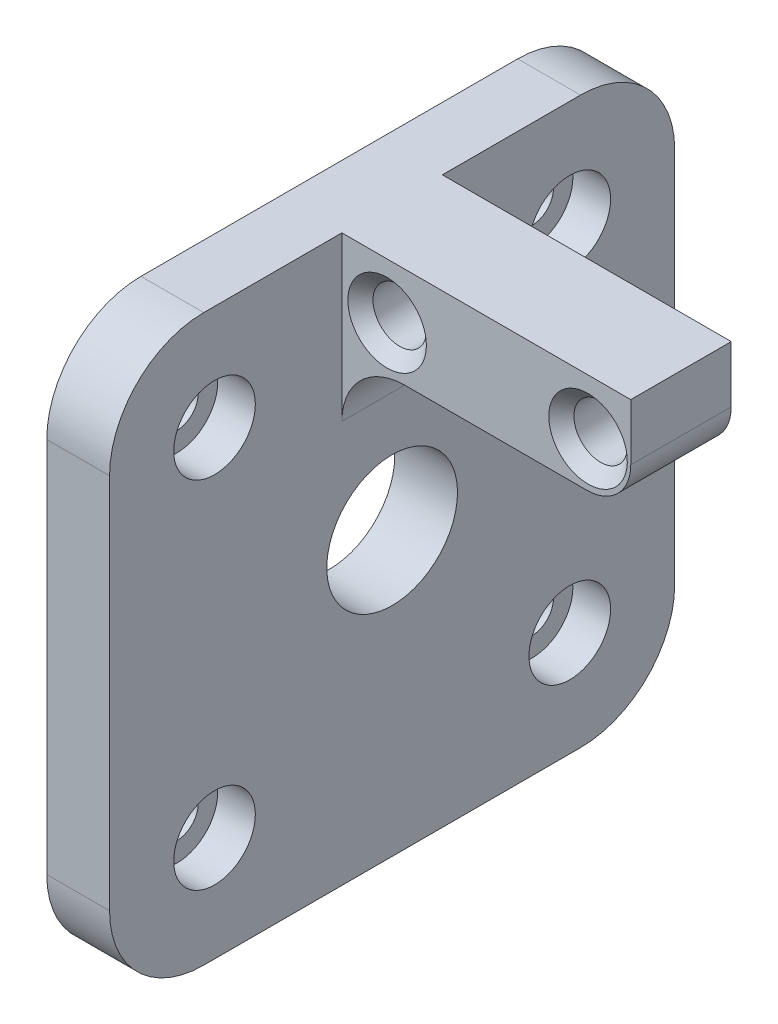
ISO-10303-21;
HEADER;
FILE_DESCRIPTION(('STEP AP214'),'2;1');
FILE_NAME('part.step','',(''),(''),'','','');
FILE_SCHEMA(('AUTOMOTIVE_DESIGN { 1 0 10303 214 1 1 1 1 }'));
ENDSEC;
DATA;
#1=APPLICATION_CONTEXT('core data for automotive mechanical design processes');
#2=APPLICATION_PROTOCOL_DEFINITION('international standard','automotive_design',2000,#1);
#3=PRODUCT_CONTEXT('',#1,'mechanical');
#4=PRODUCT('Part','Part','',(#3));
#5=PRODUCT_RELATED_PRODUCT_CATEGORY('part','',(#4));
#6=PRODUCT_DEFINITION_FORMATION('','',#4);
#7=PRODUCT_DEFINITION_CONTEXT('part definition',#1,'design');
#8=PRODUCT_DEFINITION('design','',#6,#7);
#9=PRODUCT_DEFINITION_SHAPE('','',#8);
#10=(LENGTH_UNIT() NAMED_UNIT(*) SI_UNIT(.MILLI.,.METRE.));
#11=(NAMED_UNIT(*) PLANE_ANGLE_UNIT() SI_UNIT($,.RADIAN.));
#12=(NAMED_UNIT(*) SI_UNIT($,.STERADIAN.) SOLID_ANGLE_UNIT());
#13=UNCERTAINTY_MEASURE_WITH_UNIT(LENGTH_MEASURE(1.E-05),#10,'distance_accuracy_value','');
#14=(GEOMETRIC_REPRESENTATION_CONTEXT(3) GLOBAL_UNCERTAINTY_ASSIGNED_CONTEXT((#13)) GLOBAL_UNIT_ASSIGNED_CONTEXT((#10,
#11,#12)) REPRESENTATION_CONTEXT('',''));
#15=CARTESIAN_POINT('',(0.,0.,0.));
#16=DIRECTION('',(0.,0.,1.));
#17=DIRECTION('',(1.,0.,0.));
#18=AXIS2_PLACEMENT_3D('',#15,#16,#17);
#19=CARTESIAN_POINT('',(5.,22.5,0.));
#20=DIRECTION('',(0.,1.,0.));
#21=DIRECTION('',(0.,0.,1.));
#22=AXIS2_PLACEMENT_3D('',#19,#20,#21);
#23=PLANE('',#22);
#24=DIRECTION('',(0.,0.,-1.));
#25=VECTOR('',#24,1.);
#26=CARTESIAN_POINT('',(5.,22.5,0.));
#27=LINE('',#26,#25);
#28=CARTESIAN_POINT('',(5.,22.5,-4.));
#29=VERTEX_POINT('',#28);
#30=CARTESIAN_POINT('',(5.,22.5,-15.));
#31=VERTEX_POINT('',#30);
#32=EDGE_CURVE('E215',#29,#31,#27,.T.);
#33=ORIENTED_EDGE('',*,*,#32,.T.);
#34=DIRECTION('',(-1.,0.,0.));
#35=VECTOR('',#34,1.);
#36=CARTESIAN_POINT('',(0.,22.5,-15.));
#37=LINE('',#36,#35);
#38=CARTESIAN_POINT('',(0.,22.5,-15.));
#39=VERTEX_POINT('',#38);
#40=EDGE_CURVE('E291',#31,#39,#37,.T.);
#41=ORIENTED_EDGE('',*,*,#40,.T.);
#42=DIRECTION('',(0.,0.,-1.));
#43=VECTOR('',#42,1.);
#44=CARTESIAN_POINT('',(0.,22.5,0.));
#45=LINE('',#44,#43);
#46=CARTESIAN_POINT('',(0.,22.5,15.));
#47=VERTEX_POINT('',#46);
#48=EDGE_CURVE('E210',#47,#39,#45,.T.);
#49=ORIENTED_EDGE('',*,*,#48,.F.);
#50=DIRECTION('',(-1.,0.,0.));
#51=VECTOR('',#50,1.);
#52=CARTESIAN_POINT('',(5.,22.5,15.));
#53=LINE('',#52,#51);
#54=CARTESIAN_POINT('',(5.,22.5,15.));
#55=VERTEX_POINT('',#54);
#56=EDGE_CURVE('E288',#47,#55,#53,.F.);
#57=ORIENTED_EDGE('',*,*,#56,.T.);
#58=CARTESIAN_POINT('',(5.,22.5,4.));
#59=VERTEX_POINT('',#58);
#60=EDGE_CURVE('E211',#55,#59,#27,.T.);
#61=ORIENTED_EDGE('',*,*,#60,.T.);
#62=DIRECTION('',(-1.,0.,0.));
#63=VECTOR('',#62,1.);
#64=CARTESIAN_POINT('',(28.,22.5,4.));
#65=LINE('',#64,#63);
#66=CARTESIAN_POINT('',(28.,22.5,4.));
#67=VERTEX_POINT('',#66);
#68=EDGE_CURVE('E176',#67,#59,#65,.T.);
#69=ORIENTED_EDGE('',*,*,#68,.F.);
#70=DIRECTION('',(0.,0.,-1.));
#71=VECTOR('',#70,1.);
#72=CARTESIAN_POINT('',(28.,22.5,0.));
#73=LINE('',#72,#71);
#74=CARTESIAN_POINT('',(28.,22.5,-4.));
#75=VERTEX_POINT('',#74);
#76=EDGE_CURVE('E183',#67,#75,#73,.T.);
#77=ORIENTED_EDGE('',*,*,#76,.T.);
#78=DIRECTION('',(-1.,0.,0.));
#79=VECTOR('',#78,1.);
#80=CARTESIAN_POINT('',(28.,22.5,-4.));
#81=LINE('',#80,#79);
#82=EDGE_CURVE('E164',#75,#29,#81,.T.);
#83=ORIENTED_EDGE('',*,*,#82,.T.);
#84=EDGE_LOOP('',(#33,#41,#49,#57,#61,#69,#77,#83));
#85=FACE_BOUND('',#84,.T.);
#86=ADVANCED_FACE('F51',(#85),#23,.T.);
#87=CARTESIAN_POINT('',(5.,0.,22.5));
#88=DIRECTION('',(0.,0.,1.));
#89=DIRECTION('',(1.,0.,0.));
#90=AXIS2_PLACEMENT_3D('',#87,#88,#89);
#91=PLANE('',#90);
#92=DIRECTION('',(0.,1.,0.));
#93=VECTOR('',#92,1.);
#94=CARTESIAN_POINT('',(0.,0.,22.5));
#95=LINE('',#94,#93);
#96=CARTESIAN_POINT('',(0.,-15.,22.5));
#97=VERTEX_POINT('',#96);
#98=CARTESIAN_POINT('',(0.,15.,22.5));
#99=VERTEX_POINT('',#98);
#100=EDGE_CURVE('E235',#97,#99,#95,.T.);
#101=ORIENTED_EDGE('',*,*,#100,.F.);
#102=DIRECTION('',(-1.,0.,0.));
#103=VECTOR('',#102,1.);
#104=CARTESIAN_POINT('',(5.,-15.,22.5));
#105=LINE('',#104,#103);
#106=CARTESIAN_POINT('',(5.,-15.,22.5));
#107=VERTEX_POINT('',#106);
#108=EDGE_CURVE('E269',#97,#107,#105,.F.);
#109=ORIENTED_EDGE('',*,*,#108,.T.);
#110=DIRECTION('',(0.,1.,0.));
#111=VECTOR('',#110,1.);
#112=CARTESIAN_POINT('',(5.,0.,22.5));
#113=LINE('',#112,#111);
#114=CARTESIAN_POINT('',(5.,15.,22.5));
#115=VERTEX_POINT('',#114);
#116=EDGE_CURVE('E214',#107,#115,#113,.T.);
#117=ORIENTED_EDGE('',*,*,#116,.T.);
#118=DIRECTION('',(-1.,0.,0.));
#119=VECTOR('',#118,1.);
#120=CARTESIAN_POINT('',(5.,15.,22.5));
#121=LINE('',#120,#119);
#122=EDGE_CURVE('E266',#115,#99,#121,.T.);
#123=ORIENTED_EDGE('',*,*,#122,.T.);
#124=EDGE_LOOP('',(#101,#109,#117,#123));
#125=FACE_BOUND('',#124,.T.);
#126=ADVANCED_FACE('F361',(#125),#91,.T.);
#127=CARTESIAN_POINT('',(5.,-22.5,0.));
#128=DIRECTION('',(0.,1.,0.));
#129=DIRECTION('',(0.,0.,1.));
#130=AXIS2_PLACEMENT_3D('',#127,#128,#129);
#131=PLANE('',#130);
#132=DIRECTION('',(0.,0.,-1.));
#133=VECTOR('',#132,1.);
#134=CARTESIAN_POINT('',(5.,-22.5,0.));
#135=LINE('',#134,#133);
#136=CARTESIAN_POINT('',(5.,-22.5,15.));
#137=VERTEX_POINT('',#136);
#138=CARTESIAN_POINT('',(5.,-22.5,-15.));
#139=VERTEX_POINT('',#138);
#140=EDGE_CURVE('E219',#137,#139,#135,.T.);
#141=ORIENTED_EDGE('',*,*,#140,.F.);
#142=DIRECTION('',(-1.,0.,0.));
#143=VECTOR('',#142,1.);
#144=CARTESIAN_POINT('',(0.,-22.5,15.));
#145=LINE('',#144,#143);
#146=CARTESIAN_POINT('',(0.,-22.5,15.));
#147=VERTEX_POINT('',#146);
#148=EDGE_CURVE('E251',#137,#147,#145,.T.);
#149=ORIENTED_EDGE('',*,*,#148,.T.);
#150=DIRECTION('',(0.,0.,-1.));
#151=VECTOR('',#150,1.);
#152=CARTESIAN_POINT('',(0.,-22.5,0.));
#153=LINE('',#152,#151);
#154=CARTESIAN_POINT('',(0.,-22.5,-15.));
#155=VERTEX_POINT('',#154);
#156=EDGE_CURVE('E238',#147,#155,#153,.T.);
#157=ORIENTED_EDGE('',*,*,#156,.T.);
#158=DIRECTION('',(-1.,0.,0.));
#159=VECTOR('',#158,1.);
#160=CARTESIAN_POINT('',(5.,-22.5,-15.));
#161=LINE('',#160,#159);
#162=EDGE_CURVE('E231',#155,#139,#161,.F.);
#163=ORIENTED_EDGE('',*,*,#162,.T.);
#164=EDGE_LOOP('',(#141,#149,#157,#163));
#165=FACE_BOUND('',#164,.T.);
#166=ADVANCED_FACE('F366',(#165),#131,.F.);
#167=CARTESIAN_POINT('',(5.,0.,-22.5));
#168=DIRECTION('',(0.,0.,1.));
#169=DIRECTION('',(1.,0.,0.));
#170=AXIS2_PLACEMENT_3D('',#167,#168,#169);
#171=PLANE('',#170);
#172=DIRECTION('',(0.,1.,0.));
#173=VECTOR('',#172,1.);
#174=CARTESIAN_POINT('',(5.,0.,-22.5));
#175=LINE('',#174,#173);
#176=CARTESIAN_POINT('',(5.,-15.,-22.5));
#177=VERTEX_POINT('',#176);
#178=CARTESIAN_POINT('',(5.,15.,-22.5));
#179=VERTEX_POINT('',#178);
#180=EDGE_CURVE('E223',#177,#179,#175,.T.);
#181=ORIENTED_EDGE('',*,*,#180,.F.);
#182=DIRECTION('',(-1.,0.,0.));
#183=VECTOR('',#182,1.);
#184=CARTESIAN_POINT('',(5.,-15.,-22.5));
#185=LINE('',#184,#183);
#186=CARTESIAN_POINT('',(0.,-15.,-22.5));
#187=VERTEX_POINT('',#186);
#188=EDGE_CURVE('E285',#177,#187,#185,.T.);
#189=ORIENTED_EDGE('',*,*,#188,.T.);
#190=DIRECTION('',(0.,1.,0.));
#191=VECTOR('',#190,1.);
#192=CARTESIAN_POINT('',(0.,0.,-22.5));
#193=LINE('',#192,#191);
#194=CARTESIAN_POINT('',(0.,15.,-22.5));
#195=VERTEX_POINT('',#194);
#196=EDGE_CURVE('E242',#187,#195,#193,.T.);
#197=ORIENTED_EDGE('',*,*,#196,.T.);
#198=DIRECTION('',(-1.,0.,0.));
#199=VECTOR('',#198,1.);
#200=CARTESIAN_POINT('',(5.,15.,-22.5));
#201=LINE('',#200,#199);
#202=EDGE_CURVE('E282',#195,#179,#201,.F.);
#203=ORIENTED_EDGE('',*,*,#202,.T.);
#204=EDGE_LOOP('',(#181,#189,#197,#203));
#205=FACE_BOUND('',#204,.T.);
#206=ADVANCED_FACE('F408',(#205),#171,.F.);
#207=CARTESIAN_POINT('',(5.,0.,0.));
#208=DIRECTION('',(-1.,0.,0.));
#209=DIRECTION('',(0.,0.,1.));
#210=AXIS2_PLACEMENT_3D('',#207,#208,#209);
#211=CYLINDRICAL_SURFACE('',#210,5.205);
#212=CARTESIAN_POINT('',(5.,0.,0.));
#213=DIRECTION('',(1.,0.,0.));
#214=DIRECTION('',(0.,0.,-1.));
#215=AXIS2_PLACEMENT_3D('',#212,#213,#214);
#216=CIRCLE('',#215,5.205);
#217=CARTESIAN_POINT('',(5.,0.,-5.205));
#218=VERTEX_POINT('',#217);
#219=EDGE_CURVE('E227',#218,#218,#216,.T.);
#220=ORIENTED_EDGE('',*,*,#219,.T.);
#221=EDGE_LOOP('',(#220));
#222=FACE_BOUND('',#221,.T.);
#223=CARTESIAN_POINT('',(0.,0.,0.));
#224=DIRECTION('',(1.,0.,0.));
#225=DIRECTION('',(0.,0.,-1.));
#226=AXIS2_PLACEMENT_3D('',#223,#224,#225);
#227=CIRCLE('',#226,5.205);
#228=CARTESIAN_POINT('',(0.,0.,-5.205));
#229=VERTEX_POINT('',#228);
#230=EDGE_CURVE('E246',#229,#229,#227,.T.);
#231=ORIENTED_EDGE('',*,*,#230,.F.);
#232=EDGE_LOOP('',(#231));
#233=FACE_BOUND('',#232,.T.);
#234=ADVANCED_FACE('F421',(#222,#233),#211,.F.);
#235=CARTESIAN_POINT('',(5.,0.,0.));
#236=DIRECTION('',(1.,0.,0.));
#237=DIRECTION('',(0.,0.,-1.));
#238=AXIS2_PLACEMENT_3D('',#235,#236,#237);
#239=PLANE('',#238);
#240=CARTESIAN_POINT('',(5.,14.142135623731,14.142135623731));
#241=DIRECTION('',(1.,0.,0.));
#242=DIRECTION('',(0.,0.,-1.));
#243=AXIS2_PLACEMENT_3D('',#240,#241,#242);
#244=CIRCLE('',#243,3.25);
#245=CARTESIAN_POINT('',(5.,14.142135623731,10.892135623731));
#246=VERTEX_POINT('',#245);
#247=EDGE_CURVE('E751',#246,#246,#244,.T.);
#248=ORIENTED_EDGE('',*,*,#247,.F.);
#249=EDGE_LOOP('',(#248));
#250=FACE_BOUND('',#249,.T.);
#251=CARTESIAN_POINT('',(5.,14.142135623731,-14.142135623731));
#252=DIRECTION('',(1.,0.,0.));
#253=DIRECTION('',(0.,0.,-1.));
#254=AXIS2_PLACEMENT_3D('',#251,#252,#253);
#255=CIRCLE('',#254,3.25);
#256=CARTESIAN_POINT('',(5.,14.142135623731,-17.392135623731));
#257=VERTEX_POINT('',#256);
#258=EDGE_CURVE('E735',#257,#257,#255,.T.);
#259=ORIENTED_EDGE('',*,*,#258,.F.);
#260=EDGE_LOOP('',(#259));
#261=FACE_BOUND('',#260,.T.);
#262=CARTESIAN_POINT('',(5.,-14.142135623731,14.142135623731));
#263=DIRECTION('',(1.,0.,0.));
#264=DIRECTION('',(0.,0.,-1.));
#265=AXIS2_PLACEMENT_3D('',#262,#263,#264);
#266=CIRCLE('',#265,3.25);
#267=CARTESIAN_POINT('',(5.,-14.142135623731,10.892135623731));
#268=VERTEX_POINT('',#267);
#269=EDGE_CURVE('E719',#268,#268,#266,.T.);
#270=ORIENTED_EDGE('',*,*,#269,.F.);
#271=EDGE_LOOP('',(#270));
#272=FACE_BOUND('',#271,.T.);
#273=CARTESIAN_POINT('',(5.,-14.142135623731,-14.142135623731));
#274=DIRECTION('',(1.,0.,0.));
#275=DIRECTION('',(0.,0.,-1.));
#276=AXIS2_PLACEMENT_3D('',#273,#274,#275);
#277=CIRCLE('',#276,3.25);
#278=CARTESIAN_POINT('',(5.,-14.142135623731,-17.392135623731));
#279=VERTEX_POINT('',#278);
#280=EDGE_CURVE('E703',#279,#279,#277,.T.);
#281=ORIENTED_EDGE('',*,*,#280,.F.);
#282=EDGE_LOOP('',(#281));
#283=FACE_BOUND('',#282,.T.);
#284=DIRECTION('',(0.,0.,1.));
#285=VECTOR('',#284,1.);
#286=CARTESIAN_POINT('',(5.,9.5,0.));
#287=LINE('',#286,#285);
#288=CARTESIAN_POINT('',(5.,9.5,-4.));
#289=VERTEX_POINT('',#288);
#290=CARTESIAN_POINT('',(5.,9.5,4.));
#291=VERTEX_POINT('',#290);
#292=EDGE_CURVE('E294',#289,#291,#287,.T.);
#293=ORIENTED_EDGE('',*,*,#292,.T.);
#294=DIRECTION('',(0.,1.,0.));
#295=VECTOR('',#294,1.);
#296=CARTESIAN_POINT('',(5.,0.,4.00000000000001));
#297=LINE('',#296,#295);
#298=EDGE_CURVE('E175',#291,#59,#297,.T.);
#299=ORIENTED_EDGE('',*,*,#298,.T.);
#300=ORIENTED_EDGE('',*,*,#60,.F.);
#301=CARTESIAN_POINT('',(5.,15.,15.));
#302=DIRECTION('',(1.,0.,0.));
#303=DIRECTION('',(0.,0.,-1.));
#304=AXIS2_PLACEMENT_3D('',#301,#302,#303);
#305=CIRCLE('',#304,7.5);
#306=EDGE_CURVE('E271',#55,#115,#305,.T.);
#307=ORIENTED_EDGE('',*,*,#306,.T.);
#308=ORIENTED_EDGE('',*,*,#116,.F.);
#309=CARTESIAN_POINT('',(5.,-15.,15.));
#310=DIRECTION('',(1.,0.,0.));
#311=DIRECTION('',(0.,0.,-1.));
#312=AXIS2_PLACEMENT_3D('',#309,#310,#311);
#313=CIRCLE('',#312,7.5);
#314=EDGE_CURVE('E279',#107,#137,#313,.T.);
#315=ORIENTED_EDGE('',*,*,#314,.T.);
#316=ORIENTED_EDGE('',*,*,#140,.T.);
#317=CARTESIAN_POINT('',(5.,-15.,-15.));
#318=DIRECTION('',(1.,0.,0.));
#319=DIRECTION('',(0.,0.,-1.));
#320=AXIS2_PLACEMENT_3D('',#317,#318,#319);
#321=CIRCLE('',#320,7.5);
#322=EDGE_CURVE('E277',#139,#177,#321,.T.);
#323=ORIENTED_EDGE('',*,*,#322,.T.);
#324=ORIENTED_EDGE('',*,*,#180,.T.);
#325=CARTESIAN_POINT('',(5.,15.,-15.));
#326=DIRECTION('',(1.,0.,0.));
#327=DIRECTION('',(0.,0.,-1.));
#328=AXIS2_PLACEMENT_3D('',#325,#326,#327);
#329=CIRCLE('',#328,7.5);
#330=EDGE_CURVE('E274',#179,#31,#329,.T.);
#331=ORIENTED_EDGE('',*,*,#330,.T.);
#332=ORIENTED_EDGE('',*,*,#32,.F.);
#333=DIRECTION('',(0.,1.,0.));
#334=VECTOR('',#333,1.);
#335=CARTESIAN_POINT('',(5.,0.,-4.00000000000001));
#336=LINE('',#335,#334);
#337=EDGE_CURVE('E169',#289,#29,#336,.T.);
#338=ORIENTED_EDGE('',*,*,#337,.F.);
#339=EDGE_LOOP('',(#293,#299,#300,#307,#308,#315,#316,#323,#324,#331,#332,#338));
#340=FACE_BOUND('',#339,.T.);
#341=ORIENTED_EDGE('',*,*,#219,.F.);
#342=EDGE_LOOP('',(#341));
#343=FACE_BOUND('',#342,.T.);
#344=ADVANCED_FACE('F393',(#250,#261,#272,#283,#340,#343),#239,.T.);
#345=CARTESIAN_POINT('',(0.,0.,0.));
#346=DIRECTION('',(1.,0.,0.));
#347=DIRECTION('',(0.,0.,-1.));
#348=AXIS2_PLACEMENT_3D('',#345,#346,#347);
#349=PLANE('',#348);
#350=CARTESIAN_POINT('',(0.,14.142135623731,14.142135623731));
#351=DIRECTION('',(1.,0.,0.));
#352=DIRECTION('',(0.,0.,-1.));
#353=AXIS2_PLACEMENT_3D('',#350,#351,#352);
#354=CIRCLE('',#353,1.7);
#355=CARTESIAN_POINT('',(0.,14.142135623731,12.442135623731));
#356=VERTEX_POINT('',#355);
#357=EDGE_CURVE('E739',#356,#356,#354,.T.);
#358=ORIENTED_EDGE('',*,*,#357,.T.);
#359=EDGE_LOOP('',(#358));
#360=FACE_BOUND('',#359,.T.);
#361=CARTESIAN_POINT('',(0.,14.142135623731,-14.142135623731));
#362=DIRECTION('',(1.,0.,0.));
#363=DIRECTION('',(0.,0.,-1.));
#364=AXIS2_PLACEMENT_3D('',#361,#362,#363);
#365=CIRCLE('',#364,1.7);
#366=CARTESIAN_POINT('',(0.,14.142135623731,-15.842135623731));
#367=VERTEX_POINT('',#366);
#368=EDGE_CURVE('E723',#367,#367,#365,.T.);
#369=ORIENTED_EDGE('',*,*,#368,.T.);
#370=EDGE_LOOP('',(#369));
#371=FACE_BOUND('',#370,.T.);
#372=CARTESIAN_POINT('',(0.,-14.142135623731,14.142135623731));
#373=DIRECTION('',(1.,0.,0.));
#374=DIRECTION('',(0.,0.,-1.));
#375=AXIS2_PLACEMENT_3D('',#372,#373,#374);
#376=CIRCLE('',#375,1.7);
#377=CARTESIAN_POINT('',(0.,-14.142135623731,12.442135623731));
#378=VERTEX_POINT('',#377);
#379=EDGE_CURVE('E707',#378,#378,#376,.T.);
#380=ORIENTED_EDGE('',*,*,#379,.T.);
#381=EDGE_LOOP('',(#380));
#382=FACE_BOUND('',#381,.T.);
#383=CARTESIAN_POINT('',(0.,-14.142135623731,-14.142135623731));
#384=DIRECTION('',(1.,0.,0.));
#385=DIRECTION('',(0.,0.,-1.));
#386=AXIS2_PLACEMENT_3D('',#383,#384,#385);
#387=CIRCLE('',#386,1.7);
#388=CARTESIAN_POINT('',(0.,-14.142135623731,-15.8421356237309));
#389=VERTEX_POINT('',#388);
#390=EDGE_CURVE('E689',#389,#389,#387,.T.);
#391=ORIENTED_EDGE('',*,*,#390,.T.);
#392=EDGE_LOOP('',(#391));
#393=FACE_BOUND('',#392,.T.);
#394=ORIENTED_EDGE('',*,*,#156,.F.);
#395=CARTESIAN_POINT('',(0.,-15.,15.));
#396=DIRECTION('',(1.,0.,0.));
#397=DIRECTION('',(0.,0.,-1.));
#398=AXIS2_PLACEMENT_3D('',#395,#396,#397);
#399=CIRCLE('',#398,7.5);
#400=EDGE_CURVE('E263',#147,#97,#399,.F.);
#401=ORIENTED_EDGE('',*,*,#400,.T.);
#402=ORIENTED_EDGE('',*,*,#100,.T.);
#403=CARTESIAN_POINT('',(0.,15.,15.));
#404=DIRECTION('',(1.,0.,0.));
#405=DIRECTION('',(0.,0.,-1.));
#406=AXIS2_PLACEMENT_3D('',#403,#404,#405);
#407=CIRCLE('',#406,7.5);
#408=EDGE_CURVE('E255',#99,#47,#407,.F.);
#409=ORIENTED_EDGE('',*,*,#408,.T.);
#410=ORIENTED_EDGE('',*,*,#48,.T.);
#411=CARTESIAN_POINT('',(0.,15.,-15.));
#412=DIRECTION('',(1.,0.,0.));
#413=DIRECTION('',(0.,0.,-1.));
#414=AXIS2_PLACEMENT_3D('',#411,#412,#413);
#415=CIRCLE('',#414,7.5);
#416=EDGE_CURVE('E258',#39,#195,#415,.F.);
#417=ORIENTED_EDGE('',*,*,#416,.T.);
#418=ORIENTED_EDGE('',*,*,#196,.F.);
#419=CARTESIAN_POINT('',(0.,-15.,-15.));
#420=DIRECTION('',(1.,0.,0.));
#421=DIRECTION('',(0.,0.,-1.));
#422=AXIS2_PLACEMENT_3D('',#419,#420,#421);
#423=CIRCLE('',#422,7.5);
#424=EDGE_CURVE('E261',#187,#155,#423,.F.);
#425=ORIENTED_EDGE('',*,*,#424,.T.);
#426=EDGE_LOOP('',(#394,#401,#402,#409,#410,#417,#418,#425));
#427=FACE_BOUND('',#426,.T.);
#428=ORIENTED_EDGE('',*,*,#230,.T.);
#429=EDGE_LOOP('',(#428));
#430=FACE_BOUND('',#429,.T.);
#431=ADVANCED_FACE('F414',(#360,#371,#382,#393,#427,#430),#349,.F.);
#432=CARTESIAN_POINT('',(28.,0.,-4.00000000000001));
#433=DIRECTION('',(0.,0.,-1.));
#434=DIRECTION('',(0.,1.,0.));
#435=AXIS2_PLACEMENT_3D('',#432,#433,#434);
#436=PLANE('',#435);
#437=CARTESIAN_POINT('',(8.60000000000001,18.1,-4.));
#438=DIRECTION('',(0.,0.,-1.));
#439=DIRECTION('',(0.,1.,0.));
#440=AXIS2_PLACEMENT_3D('',#437,#438,#439);
#441=CIRCLE('',#440,2.125);
#442=CARTESIAN_POINT('',(8.60000000000001,20.225,-4.));
#443=VERTEX_POINT('',#442);
#444=EDGE_CURVE('E186',#443,#443,#441,.T.);
#445=ORIENTED_EDGE('',*,*,#444,.F.);
#446=EDGE_LOOP('',(#445));
#447=FACE_BOUND('',#446,.T.);
#448=CARTESIAN_POINT('',(24.6,18.1,-4.));
#449=DIRECTION('',(0.,0.,-1.));
#450=DIRECTION('',(0.,1.,0.));
#451=AXIS2_PLACEMENT_3D('',#448,#449,#450);
#452=CIRCLE('',#451,2.125);
#453=CARTESIAN_POINT('',(24.6,20.225,-4.));
#454=VERTEX_POINT('',#453);
#455=EDGE_CURVE('E687',#454,#454,#452,.T.);
#456=ORIENTED_EDGE('',*,*,#455,.F.);
#457=EDGE_LOOP('',(#456));
#458=FACE_BOUND('',#457,.T.);
#459=DIRECTION('',(0.,-1.,0.));
#460=VECTOR('',#459,1.);
#461=CARTESIAN_POINT('',(28.,0.,-4.00000000000001));
#462=LINE('',#461,#460);
#463=CARTESIAN_POINT('',(28.,18.,-4.));
#464=VERTEX_POINT('',#463);
#465=EDGE_CURVE('E167',#75,#464,#462,.T.);
#466=ORIENTED_EDGE('',*,*,#465,.T.);
#467=CARTESIAN_POINT('',(24.5,18.,-4.));
#468=DIRECTION('',(0.,0.,-1.));
#469=DIRECTION('',(0.,1.,0.));
#470=AXIS2_PLACEMENT_3D('',#467,#468,#469);
#471=CIRCLE('',#470,3.5);
#472=CARTESIAN_POINT('',(24.5,14.5,-4.));
#473=VERTEX_POINT('',#472);
#474=EDGE_CURVE('E76',#464,#473,#471,.T.);
#475=ORIENTED_EDGE('',*,*,#474,.T.);
#476=DIRECTION('',(-1.,0.,0.));
#477=VECTOR('',#476,1.);
#478=CARTESIAN_POINT('',(28.,14.5,-4.));
#479=LINE('',#478,#477);
#480=CARTESIAN_POINT('',(9.99999999999999,14.5,-4.));
#481=VERTEX_POINT('',#480);
#482=EDGE_CURVE('E196',#473,#481,#479,.T.);
#483=ORIENTED_EDGE('',*,*,#482,.T.);
#484=CARTESIAN_POINT('',(10.,9.5,-4.));
#485=DIRECTION('',(0.,0.,-1.));
#486=DIRECTION('',(0.,1.,0.));
#487=AXIS2_PLACEMENT_3D('',#484,#485,#486);
#488=CIRCLE('',#487,5.);
#489=EDGE_CURVE('E306',#481,#289,#488,.F.);
#490=ORIENTED_EDGE('',*,*,#489,.T.);
#491=ORIENTED_EDGE('',*,*,#337,.T.);
#492=ORIENTED_EDGE('',*,*,#82,.F.);
#493=EDGE_LOOP('',(#466,#475,#483,#490,#491,#492));
#494=FACE_BOUND('',#493,.T.);
#495=ADVANCED_FACE('F166',(#447,#458,#494),#436,.T.);
#496=CARTESIAN_POINT('',(28.,0.,4.00000000000001));
#497=DIRECTION('',(0.,0.,-1.));
#498=DIRECTION('',(0.,1.,0.));
#499=AXIS2_PLACEMENT_3D('',#496,#497,#498);
#500=PLANE('',#499);
#501=CARTESIAN_POINT('',(24.6,18.1,4.));
#502=DIRECTION('',(0.,0.,-1.));
#503=DIRECTION('',(0.,1.,0.));
#504=AXIS2_PLACEMENT_3D('',#501,#502,#503);
#505=CIRCLE('',#504,3.12499999999996);
#506=CARTESIAN_POINT('',(24.6,21.2249999999999,4.));
#507=VERTEX_POINT('',#506);
#508=EDGE_CURVE('E320',#507,#507,#505,.T.);
#509=ORIENTED_EDGE('',*,*,#508,.T.);
#510=EDGE_LOOP('',(#509));
#511=FACE_BOUND('',#510,.T.);
#512=CARTESIAN_POINT('',(8.60000000000001,18.1,4.));
#513=DIRECTION('',(0.,0.,-1.));
#514=DIRECTION('',(0.,1.,0.));
#515=AXIS2_PLACEMENT_3D('',#512,#513,#514);
#516=CIRCLE('',#515,3.12499999999996);
#517=CARTESIAN_POINT('',(8.60000000000001,21.225,4.));
#518=VERTEX_POINT('',#517);
#519=EDGE_CURVE('E316',#518,#518,#516,.T.);
#520=ORIENTED_EDGE('',*,*,#519,.T.);
#521=EDGE_LOOP('',(#520));
#522=FACE_BOUND('',#521,.T.);
#523=DIRECTION('',(-1.,0.,0.));
#524=VECTOR('',#523,1.);
#525=CARTESIAN_POINT('',(28.,14.5,4.));
#526=LINE('',#525,#524);
#527=CARTESIAN_POINT('',(24.5,14.5,4.));
#528=VERTEX_POINT('',#527);
#529=CARTESIAN_POINT('',(9.99999999999999,14.5,4.));
#530=VERTEX_POINT('',#529);
#531=EDGE_CURVE('E201',#528,#530,#526,.T.);
#532=ORIENTED_EDGE('',*,*,#531,.F.);
#533=CARTESIAN_POINT('',(24.5,18.,4.));
#534=DIRECTION('',(0.,0.,-1.));
#535=DIRECTION('',(0.,1.,0.));
#536=AXIS2_PLACEMENT_3D('',#533,#534,#535);
#537=CIRCLE('',#536,3.5);
#538=CARTESIAN_POINT('',(28.,18.,4.));
#539=VERTEX_POINT('',#538);
#540=EDGE_CURVE('E313',#528,#539,#537,.F.);
#541=ORIENTED_EDGE('',*,*,#540,.T.);
#542=DIRECTION('',(0.,-1.,0.));
#543=VECTOR('',#542,1.);
#544=CARTESIAN_POINT('',(28.,0.,4.00000000000001));
#545=LINE('',#544,#543);
#546=EDGE_CURVE('E191',#67,#539,#545,.T.);
#547=ORIENTED_EDGE('',*,*,#546,.F.);
#548=ORIENTED_EDGE('',*,*,#68,.T.);
#549=ORIENTED_EDGE('',*,*,#298,.F.);
#550=CARTESIAN_POINT('',(10.,9.5,4.));
#551=DIRECTION('',(0.,0.,-1.));
#552=DIRECTION('',(0.,1.,0.));
#553=AXIS2_PLACEMENT_3D('',#550,#551,#552);
#554=CIRCLE('',#553,5.);
#555=EDGE_CURVE('E302',#291,#530,#554,.T.);
#556=ORIENTED_EDGE('',*,*,#555,.T.);
#557=EDGE_LOOP('',(#532,#541,#547,#548,#549,#556));
#558=FACE_BOUND('',#557,.T.);
#559=ADVANCED_FACE('F336',(#511,#522,#558),#500,.F.);
#560=CARTESIAN_POINT('',(28.,14.5,0.));
#561=DIRECTION('',(0.,1.,0.));
#562=DIRECTION('',(0.,0.,1.));
#563=AXIS2_PLACEMENT_3D('',#560,#561,#562);
#564=PLANE('',#563);
#565=ORIENTED_EDGE('',*,*,#482,.F.);
#566=DIRECTION('',(0.,0.,-1.));
#567=VECTOR('',#566,1.);
#568=CARTESIAN_POINT('',(24.5,14.5,4.));
#569=LINE('',#568,#567);
#570=EDGE_CURVE('E68',#473,#528,#569,.F.);
#571=ORIENTED_EDGE('',*,*,#570,.T.);
#572=ORIENTED_EDGE('',*,*,#531,.T.);
#573=DIRECTION('',(0.,0.,1.));
#574=VECTOR('',#573,1.);
#575=CARTESIAN_POINT('',(9.99999999999999,14.5,0.));
#576=LINE('',#575,#574);
#577=EDGE_CURVE('E298',#530,#481,#576,.F.);
#578=ORIENTED_EDGE('',*,*,#577,.T.);
#579=EDGE_LOOP('',(#565,#571,#572,#578));
#580=FACE_BOUND('',#579,.T.);
#581=ADVANCED_FACE('F339',(#580),#564,.F.);
#582=CARTESIAN_POINT('',(28.,0.,0.));
#583=DIRECTION('',(1.,0.,0.));
#584=DIRECTION('',(0.,0.,-1.));
#585=AXIS2_PLACEMENT_3D('',#582,#583,#584);
#586=PLANE('',#585);
#587=ORIENTED_EDGE('',*,*,#546,.T.);
#588=DIRECTION('',(0.,0.,-1.));
#589=VECTOR('',#588,1.);
#590=CARTESIAN_POINT('',(28.,18.,-4.));
#591=LINE('',#590,#589);
#592=EDGE_CURVE('E185',#539,#464,#591,.T.);
#593=ORIENTED_EDGE('',*,*,#592,.T.);
#594=ORIENTED_EDGE('',*,*,#465,.F.);
#595=ORIENTED_EDGE('',*,*,#76,.F.);
#596=EDGE_LOOP('',(#587,#593,#594,#595));
#597=FACE_BOUND('',#596,.T.);
#598=ADVANCED_FACE('F182',(#597),#586,.T.);
#599=CARTESIAN_POINT('',(5.,-15.,15.));
#600=DIRECTION('',(1.,0.,0.));
#601=DIRECTION('',(0.,0.,-1.));
#602=AXIS2_PLACEMENT_3D('',#599,#600,#601);
#603=CYLINDRICAL_SURFACE('',#602,7.5);
#604=ORIENTED_EDGE('',*,*,#314,.F.);
#605=ORIENTED_EDGE('',*,*,#108,.F.);
#606=ORIENTED_EDGE('',*,*,#400,.F.);
#607=ORIENTED_EDGE('',*,*,#148,.F.);
#608=EDGE_LOOP('',(#604,#605,#606,#607));
#609=FACE_BOUND('',#608,.T.);
#610=ADVANCED_FACE('F371',(#609),#603,.T.);
#611=CARTESIAN_POINT('',(5.,-15.,-15.));
#612=DIRECTION('',(-1.,0.,0.));
#613=DIRECTION('',(0.,0.,1.));
#614=AXIS2_PLACEMENT_3D('',#611,#612,#613);
#615=CYLINDRICAL_SURFACE('',#614,7.5);
#616=ORIENTED_EDGE('',*,*,#322,.F.);
#617=ORIENTED_EDGE('',*,*,#162,.F.);
#618=ORIENTED_EDGE('',*,*,#424,.F.);
#619=ORIENTED_EDGE('',*,*,#188,.F.);
#620=EDGE_LOOP('',(#616,#617,#618,#619));
#621=FACE_BOUND('',#620,.T.);
#622=ADVANCED_FACE('F374',(#621),#615,.T.);
#623=CARTESIAN_POINT('',(5.,15.,-15.));
#624=DIRECTION('',(1.,0.,0.));
#625=DIRECTION('',(0.,0.,-1.));
#626=AXIS2_PLACEMENT_3D('',#623,#624,#625);
#627=CYLINDRICAL_SURFACE('',#626,7.5);
#628=ORIENTED_EDGE('',*,*,#330,.F.);
#629=ORIENTED_EDGE('',*,*,#202,.F.);
#630=ORIENTED_EDGE('',*,*,#416,.F.);
#631=ORIENTED_EDGE('',*,*,#40,.F.);
#632=EDGE_LOOP('',(#628,#629,#630,#631));
#633=FACE_BOUND('',#632,.T.);
#634=ADVANCED_FACE('F378',(#633),#627,.T.);
#635=CARTESIAN_POINT('',(5.,15.,15.));
#636=DIRECTION('',(-1.,0.,0.));
#637=DIRECTION('',(0.,0.,1.));
#638=AXIS2_PLACEMENT_3D('',#635,#636,#637);
#639=CYLINDRICAL_SURFACE('',#638,7.5);
#640=ORIENTED_EDGE('',*,*,#306,.F.);
#641=ORIENTED_EDGE('',*,*,#56,.F.);
#642=ORIENTED_EDGE('',*,*,#408,.F.);
#643=ORIENTED_EDGE('',*,*,#122,.F.);
#644=EDGE_LOOP('',(#640,#641,#642,#643));
#645=FACE_BOUND('',#644,.T.);
#646=ADVANCED_FACE('F357',(#645),#639,.T.);
#647=CARTESIAN_POINT('',(10.,9.5,0.));
#648=DIRECTION('',(0.,0.,1.));
#649=DIRECTION('',(1.,0.,0.));
#650=AXIS2_PLACEMENT_3D('',#647,#648,#649);
#651=CYLINDRICAL_SURFACE('',#650,5.);
#652=ORIENTED_EDGE('',*,*,#489,.F.);
#653=ORIENTED_EDGE('',*,*,#577,.F.);
#654=ORIENTED_EDGE('',*,*,#555,.F.);
#655=ORIENTED_EDGE('',*,*,#292,.F.);
#656=EDGE_LOOP('',(#652,#653,#654,#655));
#657=FACE_BOUND('',#656,.T.);
#658=ADVANCED_FACE('F349',(#657),#651,.F.);
#659=CARTESIAN_POINT('',(24.5,18.,0.));
#660=DIRECTION('',(0.,0.,1.));
#661=DIRECTION('',(1.,0.,0.));
#662=AXIS2_PLACEMENT_3D('',#659,#660,#661);
#663=CYLINDRICAL_SURFACE('',#662,3.5);
#664=ORIENTED_EDGE('',*,*,#540,.F.);
#665=ORIENTED_EDGE('',*,*,#570,.F.);
#666=ORIENTED_EDGE('',*,*,#474,.F.);
#667=ORIENTED_EDGE('',*,*,#592,.F.);
#668=EDGE_LOOP('',(#664,#665,#666,#667));
#669=FACE_BOUND('',#668,.T.);
#670=ADVANCED_FACE('F347',(#669),#663,.T.);
#671=CARTESIAN_POINT('',(24.6,18.1,-22.5));
#672=DIRECTION('',(0.,0.,1.));
#673=DIRECTION('',(1.,0.,0.));
#674=AXIS2_PLACEMENT_3D('',#671,#672,#673);
#675=CYLINDRICAL_SURFACE('',#674,2.125);
#676=CARTESIAN_POINT('',(24.6,18.1,3.00000000000004));
#677=DIRECTION('',(0.,0.,-1.));
#678=DIRECTION('',(-1.,0.,0.));
#679=AXIS2_PLACEMENT_3D('',#676,#677,#678);
#680=CIRCLE('',#679,2.125);
#681=CARTESIAN_POINT('',(22.475,18.1,3.00000000000004));
#682=VERTEX_POINT('',#681);
#683=EDGE_CURVE('E61',#682,#682,#680,.F.);
#684=ORIENTED_EDGE('',*,*,#683,.T.);
#685=EDGE_LOOP('',(#684));
#686=FACE_BOUND('',#685,.T.);
#687=ORIENTED_EDGE('',*,*,#455,.T.);
#688=EDGE_LOOP('',(#687));
#689=FACE_BOUND('',#688,.T.);
#690=ADVANCED_FACE('F327',(#686,#689),#675,.F.);
#691=CARTESIAN_POINT('',(8.60000000000001,18.1,-22.5));
#692=DIRECTION('',(0.,0.,1.));
#693=DIRECTION('',(1.,0.,0.));
#694=AXIS2_PLACEMENT_3D('',#691,#692,#693);
#695=CYLINDRICAL_SURFACE('',#694,2.125);
#696=CARTESIAN_POINT('',(8.60000000000001,18.1,3.00000000000003));
#697=DIRECTION('',(0.,0.,-1.));
#698=DIRECTION('',(-1.,0.,0.));
#699=AXIS2_PLACEMENT_3D('',#696,#697,#698);
#700=CIRCLE('',#699,2.125);
#701=CARTESIAN_POINT('',(6.47500000000001,18.1,3.00000000000003));
#702=VERTEX_POINT('',#701);
#703=EDGE_CURVE('E11',#702,#702,#700,.F.);
#704=ORIENTED_EDGE('',*,*,#703,.T.);
#705=EDGE_LOOP('',(#704));
#706=FACE_BOUND('',#705,.T.);
#707=ORIENTED_EDGE('',*,*,#444,.T.);
#708=EDGE_LOOP('',(#707));
#709=FACE_BOUND('',#708,.T.);
#710=ADVANCED_FACE('F355',(#706,#709),#695,.F.);
#711=CARTESIAN_POINT('',(5.,-14.142135623731,-14.142135623731));
#712=DIRECTION('',(1.,0.,0.));
#713=DIRECTION('',(0.,0.,-1.));
#714=AXIS2_PLACEMENT_3D('',#711,#712,#713);
#715=CYLINDRICAL_SURFACE('',#714,1.7);
#716=ORIENTED_EDGE('',*,*,#390,.F.);
#717=EDGE_LOOP('',(#716));
#718=FACE_BOUND('',#717,.T.);
#719=CARTESIAN_POINT('',(2.,-14.142135623731,-14.142135623731));
#720=DIRECTION('',(1.,0.,0.));
#721=DIRECTION('',(0.,0.,-1.));
#722=AXIS2_PLACEMENT_3D('',#719,#720,#721);
#723=CIRCLE('',#722,1.7);
#724=CARTESIAN_POINT('',(2.,-14.142135623731,-15.842135623731));
#725=VERTEX_POINT('',#724);
#726=EDGE_CURVE('E695',#725,#725,#723,.T.);
#727=ORIENTED_EDGE('',*,*,#726,.T.);
#728=EDGE_LOOP('',(#727));
#729=FACE_BOUND('',#728,.T.);
#730=ADVANCED_FACE('F475',(#718,#729),#715,.F.);
#731=CARTESIAN_POINT('',(2.,-12.442135623731,-14.142135623731));
#732=DIRECTION('',(-1.,0.,0.));
#733=DIRECTION('',(0.,0.,1.));
#734=AXIS2_PLACEMENT_3D('',#731,#732,#733);
#735=PLANE('',#734);
#736=ORIENTED_EDGE('',*,*,#726,.F.);
#737=EDGE_LOOP('',(#736));
#738=FACE_BOUND('',#737,.T.);
#739=CARTESIAN_POINT('',(2.,-14.142135623731,-14.142135623731));
#740=DIRECTION('',(1.,0.,0.));
#741=DIRECTION('',(0.,0.,-1.));
#742=AXIS2_PLACEMENT_3D('',#739,#740,#741);
#743=CIRCLE('',#742,3.25);
#744=CARTESIAN_POINT('',(2.,-14.142135623731,-17.392135623731));
#745=VERTEX_POINT('',#744);
#746=EDGE_CURVE('E699',#745,#745,#743,.T.);
#747=ORIENTED_EDGE('',*,*,#746,.T.);
#748=EDGE_LOOP('',(#747));
#749=FACE_BOUND('',#748,.T.);
#750=ADVANCED_FACE('F541',(#738,#749),#735,.F.);
#751=CARTESIAN_POINT('',(5.,-14.142135623731,-14.142135623731));
#752=DIRECTION('',(1.,0.,0.));
#753=DIRECTION('',(0.,0.,-1.));
#754=AXIS2_PLACEMENT_3D('',#751,#752,#753);
#755=CYLINDRICAL_SURFACE('',#754,3.25);
#756=ORIENTED_EDGE('',*,*,#746,.F.);
#757=EDGE_LOOP('',(#756));
#758=FACE_BOUND('',#757,.T.);
#759=ORIENTED_EDGE('',*,*,#280,.T.);
#760=EDGE_LOOP('',(#759));
#761=FACE_BOUND('',#760,.T.);
#762=ADVANCED_FACE('F551',(#758,#761),#755,.F.);
#763=CARTESIAN_POINT('',(5.,-14.142135623731,14.142135623731));
#764=DIRECTION('',(1.,0.,0.));
#765=DIRECTION('',(0.,0.,-1.));
#766=AXIS2_PLACEMENT_3D('',#763,#764,#765);
#767=CYLINDRICAL_SURFACE('',#766,1.7);
#768=ORIENTED_EDGE('',*,*,#379,.F.);
#769=EDGE_LOOP('',(#768));
#770=FACE_BOUND('',#769,.T.);
#771=CARTESIAN_POINT('',(2.,-14.142135623731,14.142135623731));
#772=DIRECTION('',(1.,0.,0.));
#773=DIRECTION('',(0.,0.,-1.));
#774=AXIS2_PLACEMENT_3D('',#771,#772,#773);
#775=CIRCLE('',#774,1.7);
#776=CARTESIAN_POINT('',(2.,-14.142135623731,12.442135623731));
#777=VERTEX_POINT('',#776);
#778=EDGE_CURVE('E711',#777,#777,#775,.T.);
#779=ORIENTED_EDGE('',*,*,#778,.T.);
#780=EDGE_LOOP('',(#779));
#781=FACE_BOUND('',#780,.T.);
#782=ADVANCED_FACE('F561',(#770,#781),#767,.F.);
#783=CARTESIAN_POINT('',(2.,-12.442135623731,14.142135623731));
#784=DIRECTION('',(-1.,0.,0.));
#785=DIRECTION('',(0.,0.,1.));
#786=AXIS2_PLACEMENT_3D('',#783,#784,#785);
#787=PLANE('',#786);
#788=ORIENTED_EDGE('',*,*,#778,.F.);
#789=EDGE_LOOP('',(#788));
#790=FACE_BOUND('',#789,.T.);
#791=CARTESIAN_POINT('',(2.,-14.142135623731,14.142135623731));
#792=DIRECTION('',(1.,0.,0.));
#793=DIRECTION('',(0.,0.,-1.));
#794=AXIS2_PLACEMENT_3D('',#791,#792,#793);
#795=CIRCLE('',#794,3.25);
#796=CARTESIAN_POINT('',(2.,-14.142135623731,10.892135623731));
#797=VERTEX_POINT('',#796);
#798=EDGE_CURVE('E715',#797,#797,#795,.T.);
#799=ORIENTED_EDGE('',*,*,#798,.T.);
#800=EDGE_LOOP('',(#799));
#801=FACE_BOUND('',#800,.T.);
#802=ADVANCED_FACE('F571',(#790,#801),#787,.F.);
#803=CARTESIAN_POINT('',(5.,-14.142135623731,14.142135623731));
#804=DIRECTION('',(1.,0.,0.));
#805=DIRECTION('',(0.,0.,-1.));
#806=AXIS2_PLACEMENT_3D('',#803,#804,#805);
#807=CYLINDRICAL_SURFACE('',#806,3.25);
#808=ORIENTED_EDGE('',*,*,#798,.F.);
#809=EDGE_LOOP('',(#808));
#810=FACE_BOUND('',#809,.T.);
#811=ORIENTED_EDGE('',*,*,#269,.T.);
#812=EDGE_LOOP('',(#811));
#813=FACE_BOUND('',#812,.T.);
#814=ADVANCED_FACE('F581',(#810,#813),#807,.F.);
#815=CARTESIAN_POINT('',(5.,14.142135623731,-14.142135623731));
#816=DIRECTION('',(1.,0.,0.));
#817=DIRECTION('',(0.,0.,-1.));
#818=AXIS2_PLACEMENT_3D('',#815,#816,#817);
#819=CYLINDRICAL_SURFACE('',#818,1.7);
#820=ORIENTED_EDGE('',*,*,#368,.F.);
#821=EDGE_LOOP('',(#820));
#822=FACE_BOUND('',#821,.T.);
#823=CARTESIAN_POINT('',(2.,14.142135623731,-14.142135623731));
#824=DIRECTION('',(1.,0.,0.));
#825=DIRECTION('',(0.,0.,-1.));
#826=AXIS2_PLACEMENT_3D('',#823,#824,#825);
#827=CIRCLE('',#826,1.7);
#828=CARTESIAN_POINT('',(2.,14.142135623731,-15.842135623731));
#829=VERTEX_POINT('',#828);
#830=EDGE_CURVE('E727',#829,#829,#827,.T.);
#831=ORIENTED_EDGE('',*,*,#830,.T.);
#832=EDGE_LOOP('',(#831));
#833=FACE_BOUND('',#832,.T.);
#834=ADVANCED_FACE('F591',(#822,#833),#819,.F.);
#835=CARTESIAN_POINT('',(2.,15.842135623731,-14.142135623731));
#836=DIRECTION('',(-1.,0.,0.));
#837=DIRECTION('',(0.,0.,1.));
#838=AXIS2_PLACEMENT_3D('',#835,#836,#837);
#839=PLANE('',#838);
#840=ORIENTED_EDGE('',*,*,#830,.F.);
#841=EDGE_LOOP('',(#840));
#842=FACE_BOUND('',#841,.T.);
#843=CARTESIAN_POINT('',(2.,14.142135623731,-14.142135623731));
#844=DIRECTION('',(1.,0.,0.));
#845=DIRECTION('',(0.,0.,-1.));
#846=AXIS2_PLACEMENT_3D('',#843,#844,#845);
#847=CIRCLE('',#846,3.25);
#848=CARTESIAN_POINT('',(2.,14.142135623731,-17.392135623731));
#849=VERTEX_POINT('',#848);
#850=EDGE_CURVE('E731',#849,#849,#847,.T.);
#851=ORIENTED_EDGE('',*,*,#850,.T.);
#852=EDGE_LOOP('',(#851));
#853=FACE_BOUND('',#852,.T.);
#854=ADVANCED_FACE('F601',(#842,#853),#839,.F.);
#855=CARTESIAN_POINT('',(5.,14.142135623731,-14.142135623731));
#856=DIRECTION('',(1.,0.,0.));
#857=DIRECTION('',(0.,0.,-1.));
#858=AXIS2_PLACEMENT_3D('',#855,#856,#857);
#859=CYLINDRICAL_SURFACE('',#858,3.25);
#860=ORIENTED_EDGE('',*,*,#850,.F.);
#861=EDGE_LOOP('',(#860));
#862=FACE_BOUND('',#861,.T.);
#863=ORIENTED_EDGE('',*,*,#258,.T.);
#864=EDGE_LOOP('',(#863));
#865=FACE_BOUND('',#864,.T.);
#866=ADVANCED_FACE('F611',(#862,#865),#859,.F.);
#867=CARTESIAN_POINT('',(5.,14.142135623731,14.142135623731));
#868=DIRECTION('',(1.,0.,0.));
#869=DIRECTION('',(0.,0.,-1.));
#870=AXIS2_PLACEMENT_3D('',#867,#868,#869);
#871=CYLINDRICAL_SURFACE('',#870,1.7);
#872=ORIENTED_EDGE('',*,*,#357,.F.);
#873=EDGE_LOOP('',(#872));
#874=FACE_BOUND('',#873,.T.);
#875=CARTESIAN_POINT('',(2.,14.142135623731,14.142135623731));
#876=DIRECTION('',(1.,0.,0.));
#877=DIRECTION('',(0.,0.,-1.));
#878=AXIS2_PLACEMENT_3D('',#875,#876,#877);
#879=CIRCLE('',#878,1.7);
#880=CARTESIAN_POINT('',(2.,14.142135623731,12.442135623731));
#881=VERTEX_POINT('',#880);
#882=EDGE_CURVE('E743',#881,#881,#879,.T.);
#883=ORIENTED_EDGE('',*,*,#882,.T.);
#884=EDGE_LOOP('',(#883));
#885=FACE_BOUND('',#884,.T.);
#886=ADVANCED_FACE('F621',(#874,#885),#871,.F.);
#887=CARTESIAN_POINT('',(2.,15.842135623731,14.142135623731));
#888=DIRECTION('',(-1.,0.,0.));
#889=DIRECTION('',(0.,0.,1.));
#890=AXIS2_PLACEMENT_3D('',#887,#888,#889);
#891=PLANE('',#890);
#892=ORIENTED_EDGE('',*,*,#882,.F.);
#893=EDGE_LOOP('',(#892));
#894=FACE_BOUND('',#893,.T.);
#895=CARTESIAN_POINT('',(2.,14.142135623731,14.142135623731));
#896=DIRECTION('',(1.,0.,0.));
#897=DIRECTION('',(0.,0.,-1.));
#898=AXIS2_PLACEMENT_3D('',#895,#896,#897);
#899=CIRCLE('',#898,3.25);
#900=CARTESIAN_POINT('',(2.,14.142135623731,10.892135623731));
#901=VERTEX_POINT('',#900);
#902=EDGE_CURVE('E747',#901,#901,#899,.T.);
#903=ORIENTED_EDGE('',*,*,#902,.T.);
#904=EDGE_LOOP('',(#903));
#905=FACE_BOUND('',#904,.T.);
#906=ADVANCED_FACE('F631',(#894,#905),#891,.F.);
#907=CARTESIAN_POINT('',(5.,14.142135623731,14.142135623731));
#908=DIRECTION('',(1.,0.,0.));
#909=DIRECTION('',(0.,0.,-1.));
#910=AXIS2_PLACEMENT_3D('',#907,#908,#909);
#911=CYLINDRICAL_SURFACE('',#910,3.25);
#912=ORIENTED_EDGE('',*,*,#902,.F.);
#913=EDGE_LOOP('',(#912));
#914=FACE_BOUND('',#913,.T.);
#915=ORIENTED_EDGE('',*,*,#247,.T.);
#916=EDGE_LOOP('',(#915));
#917=FACE_BOUND('',#916,.T.);
#918=ADVANCED_FACE('F333',(#914,#917),#911,.F.);
#919=CARTESIAN_POINT('',(24.6,18.1,4.));
#920=DIRECTION('',(0.,0.,1.));
#921=DIRECTION('',(1.,0.,0.));
#922=AXIS2_PLACEMENT_3D('',#919,#920,#921);
#923=CONICAL_SURFACE('',#922,3.12499999999996,0.785398163397445);
#924=ORIENTED_EDGE('',*,*,#683,.F.);
#925=EDGE_LOOP('',(#924));
#926=FACE_BOUND('',#925,.T.);
#927=ORIENTED_EDGE('',*,*,#508,.F.);
#928=EDGE_LOOP('',(#927));
#929=FACE_BOUND('',#928,.T.);
#930=ADVANCED_FACE('F330',(#926,#929),#923,.F.);
#931=CARTESIAN_POINT('',(8.60000000000001,18.1,4.));
#932=DIRECTION('',(0.,0.,1.));
#933=DIRECTION('',(1.,0.,0.));
#934=AXIS2_PLACEMENT_3D('',#931,#932,#933);
#935=CONICAL_SURFACE('',#934,3.12499999999996,0.785398163397445);
#936=ORIENTED_EDGE('',*,*,#703,.F.);
#937=EDGE_LOOP('',(#936));
#938=FACE_BOUND('',#937,.T.);
#939=ORIENTED_EDGE('',*,*,#519,.F.);
#940=EDGE_LOOP('',(#939));
#941=FACE_BOUND('',#940,.T.);
#942=ADVANCED_FACE('F54',(#938,#941),#935,.F.);
#943=CLOSED_SHELL('',(#86,#126,#166,#206,#234,#344,#431,#495,#559,#581,#598,#610,#622,#634,#646,
#658,#670,#690,#710,#730,#750,#762,#782,#802,#814,#834,#854,#866,#886,#906,#918,#930,#942));
#944=MANIFOLD_SOLID_BREP('B2',#943);
#945=ADVANCED_BREP_SHAPE_REPRESENTATION('',(#18,#944),#14);
#946=SHAPE_DEFINITION_REPRESENTATION(#9,#945);
ENDSEC;
END-ISO-10303-21;
